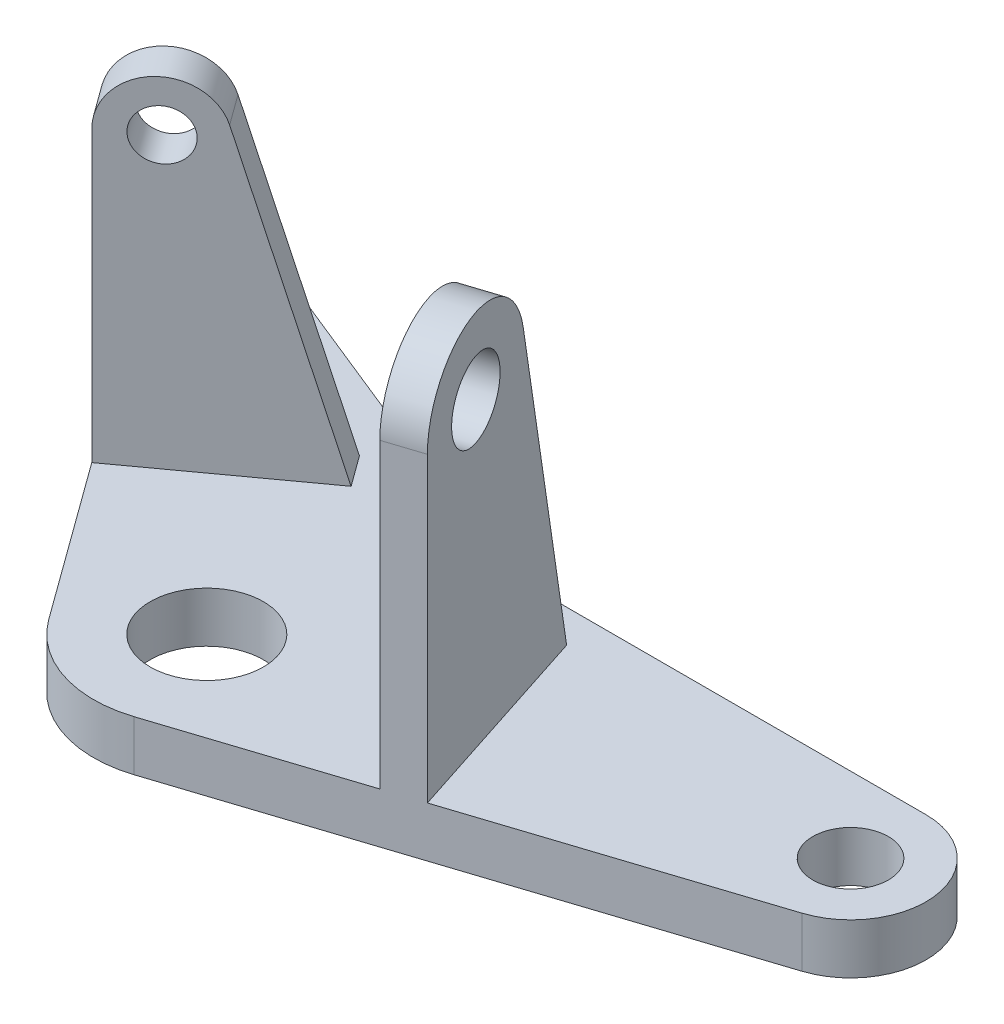
ISO-10303-21;
HEADER;
FILE_DESCRIPTION(('STEP AP214'),'2;1');
FILE_NAME('part.step','',(''),(''),'','','');
FILE_SCHEMA(('AUTOMOTIVE_DESIGN { 1 0 10303 214 1 1 1 1 }'));
ENDSEC;
DATA;
#1=APPLICATION_CONTEXT('core data for automotive mechanical design processes');
#2=APPLICATION_PROTOCOL_DEFINITION('international standard','automotive_design',2000,#1);
#3=PRODUCT_CONTEXT('',#1,'mechanical');
#4=PRODUCT('Part','Part','',(#3));
#5=PRODUCT_RELATED_PRODUCT_CATEGORY('part','',(#4));
#6=PRODUCT_DEFINITION_FORMATION('','',#4);
#7=PRODUCT_DEFINITION_CONTEXT('part definition',#1,'design');
#8=PRODUCT_DEFINITION('design','',#6,#7);
#9=PRODUCT_DEFINITION_SHAPE('','',#8);
#10=(LENGTH_UNIT() NAMED_UNIT(*) SI_UNIT(.MILLI.,.METRE.));
#11=(NAMED_UNIT(*) PLANE_ANGLE_UNIT() SI_UNIT($,.RADIAN.));
#12=(NAMED_UNIT(*) SI_UNIT($,.STERADIAN.) SOLID_ANGLE_UNIT());
#13=UNCERTAINTY_MEASURE_WITH_UNIT(LENGTH_MEASURE(1.E-05),#10,'distance_accuracy_value','');
#14=(GEOMETRIC_REPRESENTATION_CONTEXT(3) GLOBAL_UNCERTAINTY_ASSIGNED_CONTEXT((#13)) GLOBAL_UNIT_ASSIGNED_CONTEXT((#10,
#11,#12)) REPRESENTATION_CONTEXT('',''));
#15=CARTESIAN_POINT('',(0.,0.,0.));
#16=DIRECTION('',(0.,0.,1.));
#17=DIRECTION('',(1.,0.,0.));
#18=AXIS2_PLACEMENT_3D('',#15,#16,#17);
#19=CARTESIAN_POINT('',(-48.,8.,-49.0533160155749));
#20=DIRECTION('',(0.,1.,0.));
#21=DIRECTION('',(0.,0.,1.));
#22=AXIS2_PLACEMENT_3D('',#19,#20,#21);
#23=PLANE('',#22);
#24=DIRECTION('',(-0.309016994374942,0.,-0.951056516295155));
#25=VECTOR('',#24,1.);
#26=CARTESIAN_POINT('',(40.7513970016697,8.,5.68538850143995));
#27=LINE('',#26,#25);
#28=CARTESIAN_POINT('',(40.7513970016697,8.,5.68538850143995));
#29=VERTEX_POINT('',#28);
#30=CARTESIAN_POINT('',(30.099333343485,8.,-27.0982924562986));
#31=VERTEX_POINT('',#30);
#32=EDGE_CURVE('E157',#29,#31,#27,.T.);
#33=ORIENTED_EDGE('',*,*,#32,.F.);
#34=DIRECTION('',(0.951056516295155,0.,-0.309016994374942));
#35=VECTOR('',#34,1.);
#36=CARTESIAN_POINT('',(5.56230589874895,8.,17.1190172933128));
#37=LINE('',#36,#35);
#38=CARTESIAN_POINT('',(85.7082039324993,8.,-8.92196355012632));
#39=VERTEX_POINT('',#38);
#40=EDGE_CURVE('E248',#29,#39,#37,.T.);
#41=ORIENTED_EDGE('',*,*,#40,.T.);
#42=CARTESIAN_POINT('',(82.,8.,-20.3346417456682));
#43=DIRECTION('',(0.,1.,0.));
#44=DIRECTION('',(0.,0.,1.));
#45=AXIS2_PLACEMENT_3D('',#42,#43,#44);
#46=CIRCLE('',#45,12.);
#47=CARTESIAN_POINT('',(82.,8.,-32.3346417456682));
#48=VERTEX_POINT('',#47);
#49=EDGE_CURVE('E251',#39,#48,#46,.T.);
#50=ORIENTED_EDGE('',*,*,#49,.T.);
#51=DIRECTION('',(-1.,0.,0.));
#52=VECTOR('',#51,1.);
#53=CARTESIAN_POINT('',(82.,8.,-32.3346417456682));
#54=LINE('',#53,#52);
#55=CARTESIAN_POINT('',(22.8998811762116,8.,-32.3346417456682));
#56=VERTEX_POINT('',#55);
#57=EDGE_CURVE('E253',#48,#56,#54,.T.);
#58=ORIENTED_EDGE('',*,*,#57,.T.);
#59=CARTESIAN_POINT('',(22.8998811762116,8.,-74.3346417456682));
#60=DIRECTION('',(0.,-1.,0.));
#61=DIRECTION('',(0.,0.,-1.));
#62=AXIS2_PLACEMENT_3D('',#59,#60,#61);
#63=CIRCLE('',#62,42.);
#64=CARTESIAN_POINT('',(7.16640425274328,8.,-35.3929198538631));
#65=VERTEX_POINT('',#64);
#66=EDGE_CURVE('E255',#56,#65,#63,.T.);
#67=ORIENTED_EDGE('',*,*,#66,.T.);
#68=DIRECTION('',(-0.927183854566787,0.,-0.374606593415913));
#69=VECTOR('',#68,1.);
#70=CARTESIAN_POINT('',(7.16640425274326,8.,-35.3929198538631));
#71=LINE('',#70,#69);
#72=CARTESIAN_POINT('',(-45.0031472526727,8.,-56.4707868521092));
#73=VERTEX_POINT('',#72);
#74=EDGE_CURVE('E257',#65,#73,#71,.T.);
#75=ORIENTED_EDGE('',*,*,#74,.T.);
#76=CARTESIAN_POINT('',(-48.,8.,-49.0533160155749));
#77=DIRECTION('',(0.,1.,0.));
#78=DIRECTION('',(0.,0.,1.));
#79=AXIS2_PLACEMENT_3D('',#76,#77,#78);
#80=CIRCLE('',#79,8.00000000000002);
#81=CARTESIAN_POINT('',(-54.4721359549996,8.,-44.3510339972351));
#82=VERTEX_POINT('',#81);
#83=EDGE_CURVE('E239',#73,#82,#80,.T.);
#84=ORIENTED_EDGE('',*,*,#83,.T.);
#85=DIRECTION('',(0.587785252292478,0.,0.809016994374944));
#86=VECTOR('',#85,1.);
#87=CARTESIAN_POINT('',(-54.4721359549996,8.,-44.3510339972351));
#88=LINE('',#87,#86);
#89=CARTESIAN_POINT('',(-36.3103602335707,8.,-19.3534942506083));
#90=VERTEX_POINT('',#89);
#91=EDGE_CURVE('E244',#82,#90,#88,.T.);
#92=ORIENTED_EDGE('',*,*,#91,.T.);
#93=DIRECTION('',(0.809016994374944,0.,-0.587785252292478));
#94=VECTOR('',#93,1.);
#95=CARTESIAN_POINT('',(-36.3103602335707,8.,-19.3534942506083));
#96=LINE('',#95,#94);
#97=CARTESIAN_POINT('',(-12.4340979494416,8.,-36.7006142098387));
#98=VERTEX_POINT('',#97);
#99=EDGE_CURVE('E207',#90,#98,#96,.T.);
#100=ORIENTED_EDGE('',*,*,#99,.T.);
#101=DIRECTION('',(-0.587785252292478,0.,-0.809016994374944));
#102=VECTOR('',#101,1.);
#103=CARTESIAN_POINT('',(-8.90738643568676,8.,-31.846512243589));
#104=LINE('',#103,#102);
#105=CARTESIAN_POINT('',(-8.90738643568676,8.,-31.846512243589));
#106=VERTEX_POINT('',#105);
#107=EDGE_CURVE('E217',#106,#98,#104,.T.);
#108=ORIENTED_EDGE('',*,*,#107,.F.);
#109=DIRECTION('',(0.809016994374944,0.,-0.587785252292478));
#110=VECTOR('',#109,1.);
#111=CARTESIAN_POINT('',(-32.7836487198158,8.,-14.4993922843587));
#112=LINE('',#111,#110);
#113=CARTESIAN_POINT('',(-32.7836487198158,8.,-14.4993922843587));
#114=VERTEX_POINT('',#113);
#115=EDGE_CURVE('E196',#114,#106,#112,.T.);
#116=ORIENTED_EDGE('',*,*,#115,.F.);
#117=CARTESIAN_POINT('',(-14.562305898749,8.,10.5801345412646));
#118=VERTEX_POINT('',#117);
#119=EDGE_CURVE('E242',#114,#118,#88,.T.);
#120=ORIENTED_EDGE('',*,*,#119,.T.);
#121=CARTESIAN_POINT('',(0.,8.,0.));
#122=DIRECTION('',(0.,1.,0.));
#123=DIRECTION('',(0.,0.,1.));
#124=AXIS2_PLACEMENT_3D('',#121,#122,#123);
#125=CIRCLE('',#124,18.);
#126=CARTESIAN_POINT('',(5.56230589874895,8.,17.1190172933128));
#127=VERTEX_POINT('',#126);
#128=EDGE_CURVE('E246',#118,#127,#125,.T.);
#129=ORIENTED_EDGE('',*,*,#128,.T.);
#130=CARTESIAN_POINT('',(35.0450579038988,8.,7.5394904676896));
#131=VERTEX_POINT('',#130);
#132=EDGE_CURVE('E249',#127,#131,#37,.T.);
#133=ORIENTED_EDGE('',*,*,#132,.T.);
#134=DIRECTION('',(-0.309016994374942,0.,-0.951056516295155));
#135=VECTOR('',#134,1.);
#136=CARTESIAN_POINT('',(35.0450579038988,8.,7.5394904676896));
#137=LINE('',#136,#135);
#138=CARTESIAN_POINT('',(24.3929942457141,8.,-25.2441904900489));
#139=VERTEX_POINT('',#138);
#140=EDGE_CURVE('E57',#131,#139,#137,.T.);
#141=ORIENTED_EDGE('',*,*,#140,.T.);
#142=DIRECTION('',(-0.951056516295155,0.,0.309016994374942));
#143=VECTOR('',#142,1.);
#144=CARTESIAN_POINT('',(30.099333343485,8.,-27.0982924562986));
#145=LINE('',#144,#143);
#146=EDGE_CURVE('E52',#31,#139,#145,.T.);
#147=ORIENTED_EDGE('',*,*,#146,.F.);
#148=EDGE_LOOP('',(#33,#41,#50,#58,#67,#75,#84,#92,#100,#108,#116,#120,#129,#133,#141,#147));
#149=FACE_BOUND('',#148,.T.);
#150=CARTESIAN_POINT('',(82.,8.,-20.3346417456682));
#151=DIRECTION('',(0.,1.,0.));
#152=DIRECTION('',(0.,0.,1.));
#153=AXIS2_PLACEMENT_3D('',#150,#151,#152);
#154=CIRCLE('',#153,6.);
#155=CARTESIAN_POINT('',(82.,8.,-14.3346417456682));
#156=VERTEX_POINT('',#155);
#157=EDGE_CURVE('E227',#156,#156,#154,.T.);
#158=ORIENTED_EDGE('',*,*,#157,.F.);
#159=EDGE_LOOP('',(#158));
#160=FACE_BOUND('',#159,.T.);
#161=CARTESIAN_POINT('',(0.,8.,0.));
#162=DIRECTION('',(0.,1.,0.));
#163=DIRECTION('',(0.,0.,1.));
#164=AXIS2_PLACEMENT_3D('',#161,#162,#163);
#165=CIRCLE('',#164,9.);
#166=CARTESIAN_POINT('',(0.,8.,9.));
#167=VERTEX_POINT('',#166);
#168=EDGE_CURVE('E233',#167,#167,#165,.T.);
#169=ORIENTED_EDGE('',*,*,#168,.F.);
#170=EDGE_LOOP('',(#169));
#171=FACE_BOUND('',#170,.T.);
#172=CARTESIAN_POINT('',(-48.,8.,-49.0533160155749));
#173=DIRECTION('',(0.,1.,0.));
#174=DIRECTION('',(0.,0.,1.));
#175=AXIS2_PLACEMENT_3D('',#172,#173,#174);
#176=CIRCLE('',#175,4.00000000000001);
#177=CARTESIAN_POINT('',(-48.,8.,-45.0533160155749));
#178=VERTEX_POINT('',#177);
#179=EDGE_CURVE('E221',#178,#178,#176,.T.);
#180=ORIENTED_EDGE('',*,*,#179,.F.);
#181=EDGE_LOOP('',(#180));
#182=FACE_BOUND('',#181,.T.);
#183=ADVANCED_FACE('F37',(#149,#160,#171,#182),#23,.T.);
#184=CARTESIAN_POINT('',(-48.,0.,-49.0533160155749));
#185=DIRECTION('',(0.,1.,0.));
#186=DIRECTION('',(0.,0.,1.));
#187=AXIS2_PLACEMENT_3D('',#184,#185,#186);
#188=PLANE('',#187);
#189=CARTESIAN_POINT('',(-48.,0.,-49.0533160155749));
#190=DIRECTION('',(0.,1.,0.));
#191=DIRECTION('',(0.,0.,1.));
#192=AXIS2_PLACEMENT_3D('',#189,#190,#191);
#193=CIRCLE('',#192,8.00000000000002);
#194=CARTESIAN_POINT('',(-45.0031472526727,0.,-56.4707868521092));
#195=VERTEX_POINT('',#194);
#196=CARTESIAN_POINT('',(-54.4721359549996,0.,-44.3510339972351));
#197=VERTEX_POINT('',#196);
#198=EDGE_CURVE('E236',#195,#197,#193,.T.);
#199=ORIENTED_EDGE('',*,*,#198,.F.);
#200=DIRECTION('',(-0.927183854566787,0.,-0.374606593415913));
#201=VECTOR('',#200,1.);
#202=CARTESIAN_POINT('',(7.16640425274326,0.,-35.3929198538631));
#203=LINE('',#202,#201);
#204=CARTESIAN_POINT('',(7.16640425274328,0.,-35.3929198538631));
#205=VERTEX_POINT('',#204);
#206=EDGE_CURVE('E243',#205,#195,#203,.T.);
#207=ORIENTED_EDGE('',*,*,#206,.F.);
#208=CARTESIAN_POINT('',(22.8998811762116,0.,-74.3346417456682));
#209=DIRECTION('',(0.,-1.,0.));
#210=DIRECTION('',(0.,0.,-1.));
#211=AXIS2_PLACEMENT_3D('',#208,#209,#210);
#212=CIRCLE('',#211,42.);
#213=CARTESIAN_POINT('',(22.8998811762116,0.,-32.3346417456682));
#214=VERTEX_POINT('',#213);
#215=EDGE_CURVE('E272',#214,#205,#212,.T.);
#216=ORIENTED_EDGE('',*,*,#215,.F.);
#217=DIRECTION('',(-1.,0.,0.));
#218=VECTOR('',#217,1.);
#219=CARTESIAN_POINT('',(82.,0.,-32.3346417456682));
#220=LINE('',#219,#218);
#221=CARTESIAN_POINT('',(82.,0.,-32.3346417456682));
#222=VERTEX_POINT('',#221);
#223=EDGE_CURVE('E270',#222,#214,#220,.T.);
#224=ORIENTED_EDGE('',*,*,#223,.F.);
#225=CARTESIAN_POINT('',(82.,0.,-20.3346417456682));
#226=DIRECTION('',(0.,1.,0.));
#227=DIRECTION('',(0.,0.,1.));
#228=AXIS2_PLACEMENT_3D('',#225,#226,#227);
#229=CIRCLE('',#228,12.);
#230=CARTESIAN_POINT('',(85.7082039324993,0.,-8.92196355012632));
#231=VERTEX_POINT('',#230);
#232=EDGE_CURVE('E268',#231,#222,#229,.T.);
#233=ORIENTED_EDGE('',*,*,#232,.F.);
#234=DIRECTION('',(0.951056516295155,0.,-0.309016994374942));
#235=VECTOR('',#234,1.);
#236=CARTESIAN_POINT('',(5.56230589874895,0.,17.1190172933128));
#237=LINE('',#236,#235);
#238=CARTESIAN_POINT('',(5.56230589874895,0.,17.1190172933128));
#239=VERTEX_POINT('',#238);
#240=EDGE_CURVE('E266',#239,#231,#237,.T.);
#241=ORIENTED_EDGE('',*,*,#240,.F.);
#242=CARTESIAN_POINT('',(0.,0.,0.));
#243=DIRECTION('',(0.,1.,0.));
#244=DIRECTION('',(0.,0.,1.));
#245=AXIS2_PLACEMENT_3D('',#242,#243,#244);
#246=CIRCLE('',#245,18.);
#247=CARTESIAN_POINT('',(-14.562305898749,0.,10.5801345412646));
#248=VERTEX_POINT('',#247);
#249=EDGE_CURVE('E264',#248,#239,#246,.T.);
#250=ORIENTED_EDGE('',*,*,#249,.F.);
#251=DIRECTION('',(0.587785252292478,0.,0.809016994374944));
#252=VECTOR('',#251,1.);
#253=CARTESIAN_POINT('',(-54.4721359549996,0.,-44.3510339972351));
#254=LINE('',#253,#252);
#255=EDGE_CURVE('E262',#197,#248,#254,.T.);
#256=ORIENTED_EDGE('',*,*,#255,.F.);
#257=EDGE_LOOP('',(#199,#207,#216,#224,#233,#241,#250,#256));
#258=FACE_BOUND('',#257,.T.);
#259=CARTESIAN_POINT('',(0.,0.,0.));
#260=DIRECTION('',(0.,1.,0.));
#261=DIRECTION('',(0.,0.,1.));
#262=AXIS2_PLACEMENT_3D('',#259,#260,#261);
#263=CIRCLE('',#262,9.);
#264=CARTESIAN_POINT('',(0.,0.,9.));
#265=VERTEX_POINT('',#264);
#266=EDGE_CURVE('E230',#265,#265,#263,.T.);
#267=ORIENTED_EDGE('',*,*,#266,.T.);
#268=EDGE_LOOP('',(#267));
#269=FACE_BOUND('',#268,.T.);
#270=CARTESIAN_POINT('',(82.,0.,-20.3346417456682));
#271=DIRECTION('',(0.,1.,0.));
#272=DIRECTION('',(0.,0.,1.));
#273=AXIS2_PLACEMENT_3D('',#270,#271,#272);
#274=CIRCLE('',#273,6.);
#275=CARTESIAN_POINT('',(82.,0.,-14.3346417456682));
#276=VERTEX_POINT('',#275);
#277=EDGE_CURVE('E224',#276,#276,#274,.T.);
#278=ORIENTED_EDGE('',*,*,#277,.T.);
#279=EDGE_LOOP('',(#278));
#280=FACE_BOUND('',#279,.T.);
#281=CARTESIAN_POINT('',(-48.,0.,-49.0533160155749));
#282=DIRECTION('',(0.,1.,0.));
#283=DIRECTION('',(0.,0.,1.));
#284=AXIS2_PLACEMENT_3D('',#281,#282,#283);
#285=CIRCLE('',#284,4.00000000000001);
#286=CARTESIAN_POINT('',(-48.,0.,-45.0533160155749));
#287=VERTEX_POINT('',#286);
#288=EDGE_CURVE('E220',#287,#287,#285,.T.);
#289=ORIENTED_EDGE('',*,*,#288,.T.);
#290=EDGE_LOOP('',(#289));
#291=FACE_BOUND('',#290,.T.);
#292=ADVANCED_FACE('F303',(#258,#269,#280,#291),#188,.F.);
#293=CARTESIAN_POINT('',(-48.,8.,-49.0533160155749));
#294=DIRECTION('',(0.,-1.,0.));
#295=DIRECTION('',(0.,0.,-1.));
#296=AXIS2_PLACEMENT_3D('',#293,#294,#295);
#297=CYLINDRICAL_SURFACE('',#296,8.00000000000002);
#298=ORIENTED_EDGE('',*,*,#198,.T.);
#299=DIRECTION('',(0.,-1.,0.));
#300=VECTOR('',#299,1.);
#301=CARTESIAN_POINT('',(-54.4721359549996,8.,-44.3510339972351));
#302=LINE('',#301,#300);
#303=EDGE_CURVE('E11',#82,#197,#302,.T.);
#304=ORIENTED_EDGE('',*,*,#303,.F.);
#305=ORIENTED_EDGE('',*,*,#83,.F.);
#306=DIRECTION('',(0.,-1.,0.));
#307=VECTOR('',#306,1.);
#308=CARTESIAN_POINT('',(-45.0031472526727,8.,-56.4707868521092));
#309=LINE('',#308,#307);
#310=EDGE_CURVE('E259',#73,#195,#309,.T.);
#311=ORIENTED_EDGE('',*,*,#310,.T.);
#312=EDGE_LOOP('',(#298,#304,#305,#311));
#313=FACE_BOUND('',#312,.T.);
#314=ADVANCED_FACE('F39',(#313),#297,.T.);
#315=CARTESIAN_POINT('',(-54.4721359549996,8.,-44.3510339972351));
#316=DIRECTION('',(0.809016994374944,0.,-0.587785252292478));
#317=DIRECTION('',(-0.587785252292478,0.,-0.809016994374944));
#318=AXIS2_PLACEMENT_3D('',#315,#316,#317);
#319=PLANE('',#318);
#320=ORIENTED_EDGE('',*,*,#255,.T.);
#321=DIRECTION('',(0.,-1.,0.));
#322=VECTOR('',#321,1.);
#323=CARTESIAN_POINT('',(-14.562305898749,8.,10.5801345412646));
#324=LINE('',#323,#322);
#325=EDGE_CURVE('E45',#118,#248,#324,.T.);
#326=ORIENTED_EDGE('',*,*,#325,.F.);
#327=ORIENTED_EDGE('',*,*,#119,.F.);
#328=DIRECTION('',(0.,-1.,0.));
#329=VECTOR('',#328,1.);
#330=CARTESIAN_POINT('',(-32.7836487198158,8.,-14.4993922843587));
#331=LINE('',#330,#329);
#332=CARTESIAN_POINT('',(-32.7836487198158,54.,-14.4993922843587));
#333=VERTEX_POINT('',#332);
#334=EDGE_CURVE('E193',#333,#114,#331,.T.);
#335=ORIENTED_EDGE('',*,*,#334,.F.);
#336=DIRECTION('',(-0.587785252292478,0.,-0.809016994374944));
#337=VECTOR('',#336,1.);
#338=CARTESIAN_POINT('',(-32.7836487198158,54.,-14.4993922843587));
#339=LINE('',#338,#337);
#340=CARTESIAN_POINT('',(-36.3103602335707,54.,-19.3534942506083));
#341=VERTEX_POINT('',#340);
#342=EDGE_CURVE('E204',#333,#341,#339,.T.);
#343=ORIENTED_EDGE('',*,*,#342,.T.);
#344=DIRECTION('',(0.,-1.,0.));
#345=VECTOR('',#344,1.);
#346=CARTESIAN_POINT('',(-36.3103602335707,8.,-19.3534942506083));
#347=LINE('',#346,#345);
#348=EDGE_CURVE('E190',#341,#90,#347,.T.);
#349=ORIENTED_EDGE('',*,*,#348,.T.);
#350=ORIENTED_EDGE('',*,*,#91,.F.);
#351=ORIENTED_EDGE('',*,*,#303,.T.);
#352=EDGE_LOOP('',(#320,#326,#327,#335,#343,#349,#350,#351));
#353=FACE_BOUND('',#352,.T.);
#354=ADVANCED_FACE('F371',(#353),#319,.F.);
#355=CARTESIAN_POINT('',(0.,8.,0.));
#356=DIRECTION('',(0.,-1.,0.));
#357=DIRECTION('',(0.,0.,-1.));
#358=AXIS2_PLACEMENT_3D('',#355,#356,#357);
#359=CYLINDRICAL_SURFACE('',#358,18.);
#360=ORIENTED_EDGE('',*,*,#249,.T.);
#361=DIRECTION('',(0.,-1.,0.));
#362=VECTOR('',#361,1.);
#363=CARTESIAN_POINT('',(5.56230589874895,8.,17.1190172933128));
#364=LINE('',#363,#362);
#365=EDGE_CURVE('E289',#127,#239,#364,.T.);
#366=ORIENTED_EDGE('',*,*,#365,.F.);
#367=ORIENTED_EDGE('',*,*,#128,.F.);
#368=ORIENTED_EDGE('',*,*,#325,.T.);
#369=EDGE_LOOP('',(#360,#366,#367,#368));
#370=FACE_BOUND('',#369,.T.);
#371=ADVANCED_FACE('F296',(#370),#359,.T.);
#372=CARTESIAN_POINT('',(5.56230589874895,8.,17.1190172933128));
#373=DIRECTION('',(-0.309016994374942,0.,-0.951056516295155));
#374=DIRECTION('',(-0.951056516295155,0.,0.309016994374942));
#375=AXIS2_PLACEMENT_3D('',#372,#373,#374);
#376=PLANE('',#375);
#377=ORIENTED_EDGE('',*,*,#240,.T.);
#378=DIRECTION('',(0.,-1.,0.));
#379=VECTOR('',#378,1.);
#380=CARTESIAN_POINT('',(85.7082039324993,8.,-8.92196355012632));
#381=LINE('',#380,#379);
#382=EDGE_CURVE('E286',#39,#231,#381,.T.);
#383=ORIENTED_EDGE('',*,*,#382,.F.);
#384=ORIENTED_EDGE('',*,*,#40,.F.);
#385=DIRECTION('',(0.,-1.,0.));
#386=VECTOR('',#385,1.);
#387=CARTESIAN_POINT('',(40.7513970016697,8.,5.68538850143995));
#388=LINE('',#387,#386);
#389=CARTESIAN_POINT('',(40.7513970016697,56.,5.68538850143995));
#390=VERTEX_POINT('',#389);
#391=EDGE_CURVE('E171',#390,#29,#388,.T.);
#392=ORIENTED_EDGE('',*,*,#391,.F.);
#393=DIRECTION('',(-0.951056516295155,0.,0.309016994374942));
#394=VECTOR('',#393,1.);
#395=CARTESIAN_POINT('',(40.7513970016697,56.,5.68538850143995));
#396=LINE('',#395,#394);
#397=CARTESIAN_POINT('',(35.0450579038988,56.,7.5394904676896));
#398=VERTEX_POINT('',#397);
#399=EDGE_CURVE('E166',#390,#398,#396,.T.);
#400=ORIENTED_EDGE('',*,*,#399,.T.);
#401=DIRECTION('',(0.,-1.,0.));
#402=VECTOR('',#401,1.);
#403=CARTESIAN_POINT('',(35.0450579038988,8.,7.5394904676896));
#404=LINE('',#403,#402);
#405=EDGE_CURVE('E181',#398,#131,#404,.T.);
#406=ORIENTED_EDGE('',*,*,#405,.T.);
#407=ORIENTED_EDGE('',*,*,#132,.F.);
#408=ORIENTED_EDGE('',*,*,#365,.T.);
#409=EDGE_LOOP('',(#377,#383,#384,#392,#400,#406,#407,#408));
#410=FACE_BOUND('',#409,.T.);
#411=ADVANCED_FACE('F309',(#410),#376,.F.);
#412=CARTESIAN_POINT('',(82.,8.,-20.3346417456682));
#413=DIRECTION('',(0.,-1.,0.));
#414=DIRECTION('',(0.,0.,-1.));
#415=AXIS2_PLACEMENT_3D('',#412,#413,#414);
#416=CYLINDRICAL_SURFACE('',#415,12.);
#417=ORIENTED_EDGE('',*,*,#232,.T.);
#418=DIRECTION('',(0.,-1.,0.));
#419=VECTOR('',#418,1.);
#420=CARTESIAN_POINT('',(82.,8.,-32.3346417456682));
#421=LINE('',#420,#419);
#422=EDGE_CURVE('E283',#48,#222,#421,.T.);
#423=ORIENTED_EDGE('',*,*,#422,.F.);
#424=ORIENTED_EDGE('',*,*,#49,.F.);
#425=ORIENTED_EDGE('',*,*,#382,.T.);
#426=EDGE_LOOP('',(#417,#423,#424,#425));
#427=FACE_BOUND('',#426,.T.);
#428=ADVANCED_FACE('F313',(#427),#416,.T.);
#429=CARTESIAN_POINT('',(82.,8.,-32.3346417456682));
#430=DIRECTION('',(0.,0.,1.));
#431=DIRECTION('',(1.,0.,0.));
#432=AXIS2_PLACEMENT_3D('',#429,#430,#431);
#433=PLANE('',#432);
#434=ORIENTED_EDGE('',*,*,#223,.T.);
#435=DIRECTION('',(0.,-1.,0.));
#436=VECTOR('',#435,1.);
#437=CARTESIAN_POINT('',(22.8998811762116,8.,-32.3346417456682));
#438=LINE('',#437,#436);
#439=EDGE_CURVE('E280',#56,#214,#438,.T.);
#440=ORIENTED_EDGE('',*,*,#439,.F.);
#441=ORIENTED_EDGE('',*,*,#57,.F.);
#442=ORIENTED_EDGE('',*,*,#422,.T.);
#443=EDGE_LOOP('',(#434,#440,#441,#442));
#444=FACE_BOUND('',#443,.T.);
#445=ADVANCED_FACE('F361',(#444),#433,.F.);
#446=CARTESIAN_POINT('',(22.8998811762116,8.,-74.3346417456682));
#447=DIRECTION('',(0.,-1.,0.));
#448=DIRECTION('',(0.,0.,-1.));
#449=AXIS2_PLACEMENT_3D('',#446,#447,#448);
#450=CYLINDRICAL_SURFACE('',#449,42.);
#451=ORIENTED_EDGE('',*,*,#215,.T.);
#452=DIRECTION('',(0.,-1.,0.));
#453=VECTOR('',#452,1.);
#454=CARTESIAN_POINT('',(7.16640425274328,8.,-35.3929198538631));
#455=LINE('',#454,#453);
#456=EDGE_CURVE('E277',#65,#205,#455,.T.);
#457=ORIENTED_EDGE('',*,*,#456,.F.);
#458=ORIENTED_EDGE('',*,*,#66,.F.);
#459=ORIENTED_EDGE('',*,*,#439,.T.);
#460=EDGE_LOOP('',(#451,#457,#458,#459));
#461=FACE_BOUND('',#460,.T.);
#462=ADVANCED_FACE('F357',(#461),#450,.F.);
#463=CARTESIAN_POINT('',(7.16640425274326,8.,-35.3929198538631));
#464=DIRECTION('',(-0.374606593415913,0.,0.927183854566787));
#465=DIRECTION('',(0.927183854566787,0.,0.374606593415913));
#466=AXIS2_PLACEMENT_3D('',#463,#464,#465);
#467=PLANE('',#466);
#468=ORIENTED_EDGE('',*,*,#206,.T.);
#469=ORIENTED_EDGE('',*,*,#310,.F.);
#470=ORIENTED_EDGE('',*,*,#74,.F.);
#471=ORIENTED_EDGE('',*,*,#456,.T.);
#472=EDGE_LOOP('',(#468,#469,#470,#471));
#473=FACE_BOUND('',#472,.T.);
#474=ADVANCED_FACE('F354',(#473),#467,.F.);
#475=CARTESIAN_POINT('',(0.,8.,0.));
#476=DIRECTION('',(0.,-1.,0.));
#477=DIRECTION('',(0.,0.,-1.));
#478=AXIS2_PLACEMENT_3D('',#475,#476,#477);
#479=CYLINDRICAL_SURFACE('',#478,9.);
#480=ORIENTED_EDGE('',*,*,#168,.T.);
#481=EDGE_LOOP('',(#480));
#482=FACE_BOUND('',#481,.T.);
#483=ORIENTED_EDGE('',*,*,#266,.F.);
#484=EDGE_LOOP('',(#483));
#485=FACE_BOUND('',#484,.T.);
#486=ADVANCED_FACE('F351',(#482,#485),#479,.F.);
#487=CARTESIAN_POINT('',(82.,8.,-20.3346417456682));
#488=DIRECTION('',(0.,-1.,0.));
#489=DIRECTION('',(0.,0.,-1.));
#490=AXIS2_PLACEMENT_3D('',#487,#488,#489);
#491=CYLINDRICAL_SURFACE('',#490,6.);
#492=ORIENTED_EDGE('',*,*,#157,.T.);
#493=EDGE_LOOP('',(#492));
#494=FACE_BOUND('',#493,.T.);
#495=ORIENTED_EDGE('',*,*,#277,.F.);
#496=EDGE_LOOP('',(#495));
#497=FACE_BOUND('',#496,.T.);
#498=ADVANCED_FACE('F419',(#494,#497),#491,.F.);
#499=CARTESIAN_POINT('',(-48.,8.,-49.0533160155749));
#500=DIRECTION('',(0.,-1.,0.));
#501=DIRECTION('',(0.,0.,-1.));
#502=AXIS2_PLACEMENT_3D('',#499,#500,#501);
#503=CYLINDRICAL_SURFACE('',#502,4.00000000000001);
#504=ORIENTED_EDGE('',*,*,#179,.T.);
#505=EDGE_LOOP('',(#504));
#506=FACE_BOUND('',#505,.T.);
#507=ORIENTED_EDGE('',*,*,#288,.F.);
#508=EDGE_LOOP('',(#507));
#509=FACE_BOUND('',#508,.T.);
#510=ADVANCED_FACE('F404',(#506,#509),#503,.F.);
#511=CARTESIAN_POINT('',(-26.3115127648162,54.,-19.2016743026985));
#512=DIRECTION('',(0.587785252292478,0.,0.809016994374944));
#513=DIRECTION('',(0.809016994374944,0.,-0.587785252292478));
#514=AXIS2_PLACEMENT_3D('',#511,#512,#513);
#515=PLANE('',#514);
#516=ORIENTED_EDGE('',*,*,#334,.T.);
#517=ORIENTED_EDGE('',*,*,#115,.T.);
#518=DIRECTION('',(-0.222995305140526,0.961261695938319,0.162015572730127));
#519=VECTOR('',#518,1.);
#520=CARTESIAN_POINT('',(-8.90738643568676,8.,-31.846512243589));
#521=LINE('',#520,#519);
#522=CARTESIAN_POINT('',(-20.09009638037,56.205098846536,-23.7217978904281));
#523=VERTEX_POINT('',#522);
#524=EDGE_CURVE('E200',#106,#523,#521,.T.);
#525=ORIENTED_EDGE('',*,*,#524,.T.);
#526=CARTESIAN_POINT('',(-26.3115127648162,54.,-19.2016743026985));
#527=DIRECTION('',(0.587785252292478,0.,0.809016994374944));
#528=DIRECTION('',(0.809016994374944,0.,-0.587785252292478));
#529=AXIS2_PLACEMENT_3D('',#526,#527,#528);
#530=CIRCLE('',#529,8.);
#531=EDGE_CURVE('E202',#523,#333,#530,.T.);
#532=ORIENTED_EDGE('',*,*,#531,.T.);
#533=EDGE_LOOP('',(#516,#517,#525,#532));
#534=FACE_BOUND('',#533,.T.);
#535=CARTESIAN_POINT('',(-26.3115127648162,54.,-19.2016743026985));
#536=DIRECTION('',(0.587785252292478,0.,0.809016994374944));
#537=DIRECTION('',(0.809016994374944,0.,-0.587785252292478));
#538=AXIS2_PLACEMENT_3D('',#535,#536,#537);
#539=CIRCLE('',#538,4.);
#540=CARTESIAN_POINT('',(-23.0754447873165,54.,-21.5528153118684));
#541=VERTEX_POINT('',#540);
#542=EDGE_CURVE('E187',#541,#541,#539,.T.);
#543=ORIENTED_EDGE('',*,*,#542,.F.);
#544=EDGE_LOOP('',(#543));
#545=FACE_BOUND('',#544,.T.);
#546=ADVANCED_FACE('F401',(#534,#545),#515,.T.);
#547=CARTESIAN_POINT('',(-29.8382242785711,54.,-24.0557762689482));
#548=DIRECTION('',(0.587785252292478,0.,0.809016994374944));
#549=DIRECTION('',(0.809016994374944,0.,-0.587785252292478));
#550=AXIS2_PLACEMENT_3D('',#547,#548,#549);
#551=PLANE('',#550);
#552=ORIENTED_EDGE('',*,*,#348,.F.);
#553=CARTESIAN_POINT('',(-29.8382242785711,54.,-24.0557762689482));
#554=DIRECTION('',(0.587785252292478,0.,0.809016994374944));
#555=DIRECTION('',(0.809016994374944,0.,-0.587785252292478));
#556=AXIS2_PLACEMENT_3D('',#553,#554,#555);
#557=CIRCLE('',#556,8.);
#558=CARTESIAN_POINT('',(-23.6168078941249,56.205098846536,-28.5758998566777));
#559=VERTEX_POINT('',#558);
#560=EDGE_CURVE('E197',#559,#341,#557,.T.);
#561=ORIENTED_EDGE('',*,*,#560,.F.);
#562=DIRECTION('',(-0.222995305140526,0.961261695938319,0.162015572730127));
#563=VECTOR('',#562,1.);
#564=CARTESIAN_POINT('',(-12.4340979494416,8.,-36.7006142098387));
#565=LINE('',#564,#563);
#566=EDGE_CURVE('E209',#98,#559,#565,.T.);
#567=ORIENTED_EDGE('',*,*,#566,.F.);
#568=ORIENTED_EDGE('',*,*,#99,.F.);
#569=EDGE_LOOP('',(#552,#561,#567,#568));
#570=FACE_BOUND('',#569,.T.);
#571=CARTESIAN_POINT('',(-29.8382242785711,54.,-24.0557762689482));
#572=DIRECTION('',(0.587785252292478,0.,0.809016994374944));
#573=DIRECTION('',(0.809016994374944,0.,-0.587785252292478));
#574=AXIS2_PLACEMENT_3D('',#571,#572,#573);
#575=CIRCLE('',#574,4.);
#576=CARTESIAN_POINT('',(-26.6021563010713,54.,-26.4069172781181));
#577=VERTEX_POINT('',#576);
#578=EDGE_CURVE('E186',#577,#577,#575,.T.);
#579=ORIENTED_EDGE('',*,*,#578,.T.);
#580=EDGE_LOOP('',(#579));
#581=FACE_BOUND('',#580,.T.);
#582=ADVANCED_FACE('F389',(#570,#581),#551,.F.);
#583=CARTESIAN_POINT('',(-8.90738643568676,8.,-31.846512243589));
#584=DIRECTION('',(-0.77767704805578,-0.275637355817,0.5650154484662));
#585=DIRECTION('',(0.587785252292478,0.,0.809016994374944));
#586=AXIS2_PLACEMENT_3D('',#583,#584,#585);
#587=PLANE('',#586);
#588=ORIENTED_EDGE('',*,*,#566,.T.);
#589=DIRECTION('',(-0.587785252292478,0.,-0.809016994374944));
#590=VECTOR('',#589,1.);
#591=CARTESIAN_POINT('',(-20.09009638037,56.205098846536,-23.7217978904281));
#592=LINE('',#591,#590);
#593=EDGE_CURVE('E214',#523,#559,#592,.T.);
#594=ORIENTED_EDGE('',*,*,#593,.F.);
#595=ORIENTED_EDGE('',*,*,#524,.F.);
#596=ORIENTED_EDGE('',*,*,#107,.T.);
#597=EDGE_LOOP('',(#588,#594,#595,#596));
#598=FACE_BOUND('',#597,.T.);
#599=ADVANCED_FACE('F399',(#598),#587,.F.);
#600=CARTESIAN_POINT('',(-26.3115127648162,54.,-19.2016743026985));
#601=DIRECTION('',(-0.587785252292478,0.,-0.809016994374944));
#602=DIRECTION('',(-0.809016994374944,0.,0.587785252292478));
#603=AXIS2_PLACEMENT_3D('',#600,#601,#602);
#604=CYLINDRICAL_SURFACE('',#603,8.);
#605=ORIENTED_EDGE('',*,*,#560,.T.);
#606=ORIENTED_EDGE('',*,*,#342,.F.);
#607=ORIENTED_EDGE('',*,*,#531,.F.);
#608=ORIENTED_EDGE('',*,*,#593,.T.);
#609=EDGE_LOOP('',(#605,#606,#607,#608));
#610=FACE_BOUND('',#609,.T.);
#611=ADVANCED_FACE('F340',(#610),#604,.T.);
#612=CARTESIAN_POINT('',(-26.3115127648162,54.,-19.2016743026985));
#613=DIRECTION('',(-0.587785252292478,0.,-0.809016994374944));
#614=DIRECTION('',(-0.809016994374944,0.,0.587785252292478));
#615=AXIS2_PLACEMENT_3D('',#612,#613,#614);
#616=CYLINDRICAL_SURFACE('',#615,4.);
#617=ORIENTED_EDGE('',*,*,#542,.T.);
#618=EDGE_LOOP('',(#617));
#619=FACE_BOUND('',#618,.T.);
#620=ORIENTED_EDGE('',*,*,#578,.F.);
#621=EDGE_LOOP('',(#620));
#622=FACE_BOUND('',#621,.T.);
#623=ADVANCED_FACE('F335',(#619,#622),#616,.F.);
#624=CARTESIAN_POINT('',(37.0431930691704,56.,-5.72728969410191));
#625=DIRECTION('',(0.951056516295155,0.,-0.309016994374942));
#626=DIRECTION('',(-0.309016994374942,0.,-0.951056516295155));
#627=AXIS2_PLACEMENT_3D('',#624,#625,#626);
#628=PLANE('',#627);
#629=ORIENTED_EDGE('',*,*,#32,.T.);
#630=DIRECTION('',(0.0642482457919163,0.978147600733806,0.197735768366174));
#631=VECTOR('',#630,1.);
#632=CARTESIAN_POINT('',(30.099333343485,8.,-27.0982924562986));
#633=LINE('',#632,#631);
#634=CARTESIAN_POINT('',(33.4160222895646,58.4949402898131,-16.8905734890182));
#635=VERTEX_POINT('',#634);
#636=EDGE_CURVE('E149',#31,#635,#633,.T.);
#637=ORIENTED_EDGE('',*,*,#636,.T.);
#638=CARTESIAN_POINT('',(37.0431930691704,56.,-5.72728969410191));
#639=DIRECTION('',(0.951056516295155,0.,-0.309016994374942));
#640=DIRECTION('',(-0.309016994374942,0.,-0.951056516295155));
#641=AXIS2_PLACEMENT_3D('',#638,#639,#640);
#642=CIRCLE('',#641,12.);
#643=EDGE_CURVE('E155',#635,#390,#642,.T.);
#644=ORIENTED_EDGE('',*,*,#643,.T.);
#645=ORIENTED_EDGE('',*,*,#391,.T.);
#646=EDGE_LOOP('',(#629,#637,#644,#645));
#647=FACE_BOUND('',#646,.T.);
#648=CARTESIAN_POINT('',(37.0431930691704,56.,-5.72728969410191));
#649=DIRECTION('',(0.951056516295155,0.,-0.309016994374942));
#650=DIRECTION('',(-0.309016994374942,0.,-0.951056516295155));
#651=AXIS2_PLACEMENT_3D('',#648,#649,#650);
#652=CIRCLE('',#651,6.);
#653=CARTESIAN_POINT('',(35.1890911029208,56.,-11.4336287918728));
#654=VERTEX_POINT('',#653);
#655=EDGE_CURVE('E177',#654,#654,#652,.T.);
#656=ORIENTED_EDGE('',*,*,#655,.F.);
#657=EDGE_LOOP('',(#656));
#658=FACE_BOUND('',#657,.T.);
#659=ADVANCED_FACE('F151',(#647,#658),#628,.T.);
#660=CARTESIAN_POINT('',(31.3368539713995,56.,-3.87318772785226));
#661=DIRECTION('',(0.951056516295155,0.,-0.309016994374942));
#662=DIRECTION('',(-0.309016994374942,0.,-0.951056516295155));
#663=AXIS2_PLACEMENT_3D('',#660,#661,#662);
#664=PLANE('',#663);
#665=ORIENTED_EDGE('',*,*,#140,.F.);
#666=ORIENTED_EDGE('',*,*,#405,.F.);
#667=CARTESIAN_POINT('',(31.3368539713995,56.,-3.87318772785226));
#668=DIRECTION('',(0.951056516295155,0.,-0.309016994374942));
#669=DIRECTION('',(-0.309016994374942,0.,-0.951056516295155));
#670=AXIS2_PLACEMENT_3D('',#667,#668,#669);
#671=CIRCLE('',#670,12.);
#672=CARTESIAN_POINT('',(27.7096831917936,58.4949402898131,-15.0364715227686));
#673=VERTEX_POINT('',#672);
#674=EDGE_CURVE('E179',#673,#398,#671,.T.);
#675=ORIENTED_EDGE('',*,*,#674,.F.);
#676=DIRECTION('',(0.0642482457919163,0.978147600733806,0.197735768366174));
#677=VECTOR('',#676,1.);
#678=CARTESIAN_POINT('',(24.3929942457141,8.,-25.2441904900489));
#679=LINE('',#678,#677);
#680=EDGE_CURVE('E163',#139,#673,#679,.T.);
#681=ORIENTED_EDGE('',*,*,#680,.F.);
#682=EDGE_LOOP('',(#665,#666,#675,#681));
#683=FACE_BOUND('',#682,.T.);
#684=CARTESIAN_POINT('',(31.3368539713995,56.,-3.87318772785226));
#685=DIRECTION('',(0.951056516295155,0.,-0.309016994374942));
#686=DIRECTION('',(-0.309016994374942,0.,-0.951056516295155));
#687=AXIS2_PLACEMENT_3D('',#684,#685,#686);
#688=CIRCLE('',#687,6.);
#689=CARTESIAN_POINT('',(29.4827520051498,56.,-9.57952682562319));
#690=VERTEX_POINT('',#689);
#691=EDGE_CURVE('E326',#690,#690,#688,.T.);
#692=ORIENTED_EDGE('',*,*,#691,.T.);
#693=EDGE_LOOP('',(#692));
#694=FACE_BOUND('',#693,.T.);
#695=ADVANCED_FACE('F320',(#683,#694),#664,.F.);
#696=CARTESIAN_POINT('',(30.099333343485,8.,-27.0982924562986));
#697=DIRECTION('',(0.302264231633821,-0.20791169081776,0.930273649576358));
#698=DIRECTION('',(0.951056516295155,0.,-0.309016994374942));
#699=AXIS2_PLACEMENT_3D('',#696,#697,#698);
#700=PLANE('',#699);
#701=ORIENTED_EDGE('',*,*,#680,.T.);
#702=DIRECTION('',(-0.951056516295155,0.,0.309016994374942));
#703=VECTOR('',#702,1.);
#704=CARTESIAN_POINT('',(33.4160222895646,58.4949402898131,-16.8905734890182));
#705=LINE('',#704,#703);
#706=EDGE_CURVE('E161',#635,#673,#705,.T.);
#707=ORIENTED_EDGE('',*,*,#706,.F.);
#708=ORIENTED_EDGE('',*,*,#636,.F.);
#709=ORIENTED_EDGE('',*,*,#146,.T.);
#710=EDGE_LOOP('',(#701,#707,#708,#709));
#711=FACE_BOUND('',#710,.T.);
#712=ADVANCED_FACE('F162',(#711),#700,.F.);
#713=CARTESIAN_POINT('',(37.0431930691704,56.,-5.72728969410191));
#714=DIRECTION('',(-0.951056516295155,0.,0.309016994374942));
#715=DIRECTION('',(0.309016994374942,0.,0.951056516295156));
#716=AXIS2_PLACEMENT_3D('',#713,#714,#715);
#717=CYLINDRICAL_SURFACE('',#716,12.);
#718=ORIENTED_EDGE('',*,*,#674,.T.);
#719=ORIENTED_EDGE('',*,*,#399,.F.);
#720=ORIENTED_EDGE('',*,*,#643,.F.);
#721=ORIENTED_EDGE('',*,*,#706,.T.);
#722=EDGE_LOOP('',(#718,#719,#720,#721));
#723=FACE_BOUND('',#722,.T.);
#724=ADVANCED_FACE('F168',(#723),#717,.T.);
#725=CARTESIAN_POINT('',(37.0431930691704,56.,-5.72728969410191));
#726=DIRECTION('',(-0.951056516295155,0.,0.309016994374942));
#727=DIRECTION('',(0.309016994374942,0.,0.951056516295156));
#728=AXIS2_PLACEMENT_3D('',#725,#726,#727);
#729=CYLINDRICAL_SURFACE('',#728,6.);
#730=ORIENTED_EDGE('',*,*,#655,.T.);
#731=EDGE_LOOP('',(#730));
#732=FACE_BOUND('',#731,.T.);
#733=ORIENTED_EDGE('',*,*,#691,.F.);
#734=EDGE_LOOP('',(#733));
#735=FACE_BOUND('',#734,.T.);
#736=ADVANCED_FACE('F333',(#732,#735),#729,.F.);
#737=CLOSED_SHELL('',(#183,#292,#314,#354,#371,#411,#428,#445,#462,#474,#486,#498,#510,#546,
#582,#599,#611,#623,#659,#695,#712,#724,#736));
#738=MANIFOLD_SOLID_BREP('B2',#737);
#739=ADVANCED_BREP_SHAPE_REPRESENTATION('',(#18,#738),#14);
#740=SHAPE_DEFINITION_REPRESENTATION(#9,#739);
ENDSEC;
END-ISO-10303-21;
